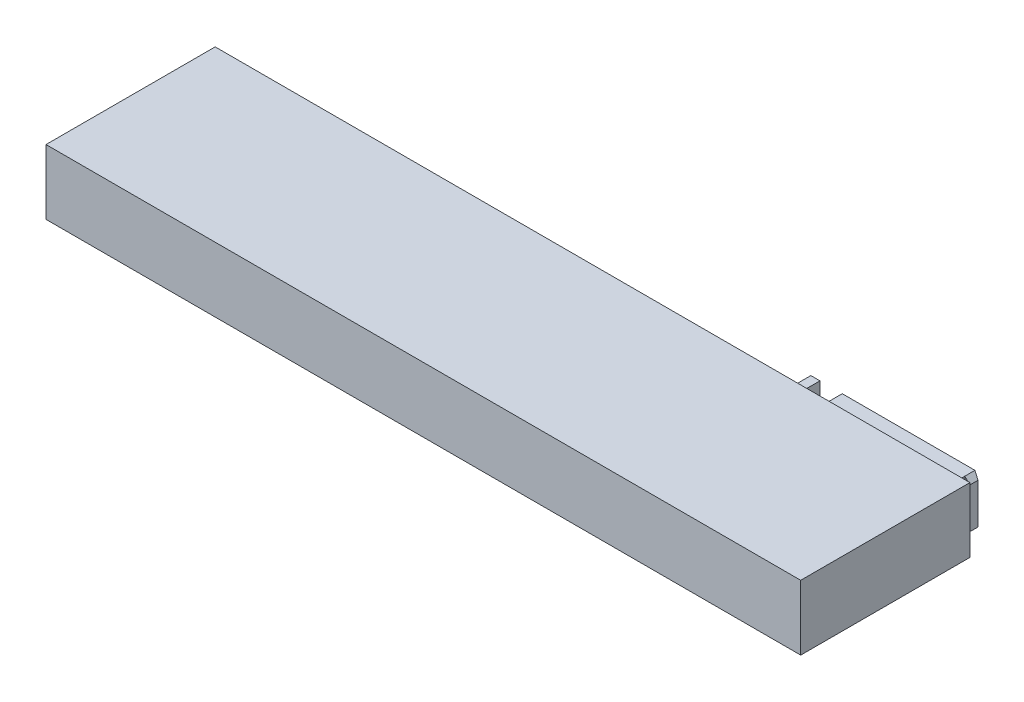
ISO-10303-21;
HEADER;
FILE_DESCRIPTION(('STEP AP214'),'2;1');
FILE_NAME('part.step','',(''),(''),'','','');
FILE_SCHEMA(('AUTOMOTIVE_DESIGN { 1 0 10303 214 1 1 1 1 }'));
ENDSEC;
DATA;
#1=APPLICATION_CONTEXT('core data for automotive mechanical design processes');
#2=APPLICATION_PROTOCOL_DEFINITION('international standard','automotive_design',2000,#1);
#3=PRODUCT_CONTEXT('',#1,'mechanical');
#4=PRODUCT('Part','Part','',(#3));
#5=PRODUCT_RELATED_PRODUCT_CATEGORY('part','',(#4));
#6=PRODUCT_DEFINITION_FORMATION('','',#4);
#7=PRODUCT_DEFINITION_CONTEXT('part definition',#1,'design');
#8=PRODUCT_DEFINITION('design','',#6,#7);
#9=PRODUCT_DEFINITION_SHAPE('','',#8);
#10=(LENGTH_UNIT() NAMED_UNIT(*) SI_UNIT(.MILLI.,.METRE.));
#11=(NAMED_UNIT(*) PLANE_ANGLE_UNIT() SI_UNIT($,.RADIAN.));
#12=(NAMED_UNIT(*) SI_UNIT($,.STERADIAN.) SOLID_ANGLE_UNIT());
#13=UNCERTAINTY_MEASURE_WITH_UNIT(LENGTH_MEASURE(1.E-05),#10,'distance_accuracy_value','');
#14=(GEOMETRIC_REPRESENTATION_CONTEXT(3) GLOBAL_UNCERTAINTY_ASSIGNED_CONTEXT((#13)) GLOBAL_UNIT_ASSIGNED_CONTEXT((#10,
#11,#12)) REPRESENTATION_CONTEXT('',''));
#15=CARTESIAN_POINT('',(0.,0.,0.));
#16=DIRECTION('',(0.,0.,1.));
#17=DIRECTION('',(1.,0.,0.));
#18=AXIS2_PLACEMENT_3D('',#15,#16,#17);
#19=CARTESIAN_POINT('',(0.,6.4,-16.7));
#20=DIRECTION('',(0.,0.,1.));
#21=DIRECTION('',(1.,0.,0.));
#22=AXIS2_PLACEMENT_3D('',#19,#20,#21);
#23=PLANE('',#22);
#24=DIRECTION('',(0.,1.,0.));
#25=VECTOR('',#24,1.);
#26=CARTESIAN_POINT('',(-17.7,5.7,-16.7));
#27=LINE('',#26,#25);
#28=CARTESIAN_POINT('',(-17.7,0.7,-16.7));
#29=VERTEX_POINT('',#28);
#30=CARTESIAN_POINT('',(-17.7,5.7,-16.7));
#31=VERTEX_POINT('',#30);
#32=EDGE_CURVE('E272',#29,#31,#27,.T.);
#33=ORIENTED_EDGE('',*,*,#32,.F.);
#34=DIRECTION('',(-1.,0.,0.));
#35=VECTOR('',#34,1.);
#36=CARTESIAN_POINT('',(-16.8,0.7,-16.7));
#37=LINE('',#36,#35);
#38=CARTESIAN_POINT('',(-16.8,0.7,-16.7));
#39=VERTEX_POINT('',#38);
#40=EDGE_CURVE('E278',#39,#29,#37,.T.);
#41=ORIENTED_EDGE('',*,*,#40,.F.);
#42=DIRECTION('',(0.,-1.,0.));
#43=VECTOR('',#42,1.);
#44=CARTESIAN_POINT('',(-16.8,5.7,-16.7));
#45=LINE('',#44,#43);
#46=CARTESIAN_POINT('',(-16.8,5.7,-16.7));
#47=VERTEX_POINT('',#46);
#48=EDGE_CURVE('E289',#47,#39,#45,.T.);
#49=ORIENTED_EDGE('',*,*,#48,.F.);
#50=DIRECTION('',(1.,0.,0.));
#51=VECTOR('',#50,1.);
#52=CARTESIAN_POINT('',(-16.8,5.7,-16.7));
#53=LINE('',#52,#51);
#54=EDGE_CURVE('E286',#31,#47,#53,.T.);
#55=ORIENTED_EDGE('',*,*,#54,.F.);
#56=EDGE_LOOP('',(#33,#41,#49,#55));
#57=FACE_BOUND('',#56,.T.);
#58=DIRECTION('',(-1.,0.,0.));
#59=VECTOR('',#58,1.);
#60=CARTESIAN_POINT('',(0.,0.,-16.7));
#61=LINE('',#60,#59);
#62=CARTESIAN_POINT('',(0.,0.,-16.7));
#63=VERTEX_POINT('',#62);
#64=CARTESIAN_POINT('',(-74.5,0.,-16.7));
#65=VERTEX_POINT('',#64);
#66=EDGE_CURVE('E347',#63,#65,#61,.T.);
#67=ORIENTED_EDGE('',*,*,#66,.T.);
#68=DIRECTION('',(0.,-1.,0.));
#69=VECTOR('',#68,1.);
#70=CARTESIAN_POINT('',(-74.5,6.4,-16.7));
#71=LINE('',#70,#69);
#72=CARTESIAN_POINT('',(-74.5,6.4,-16.7));
#73=VERTEX_POINT('',#72);
#74=EDGE_CURVE('E357',#73,#65,#71,.T.);
#75=ORIENTED_EDGE('',*,*,#74,.F.);
#76=DIRECTION('',(-1.,0.,0.));
#77=VECTOR('',#76,1.);
#78=CARTESIAN_POINT('',(0.,6.4,-16.7));
#79=LINE('',#78,#77);
#80=CARTESIAN_POINT('',(0.,6.4,-16.7));
#81=VERTEX_POINT('',#80);
#82=EDGE_CURVE('E337',#81,#73,#79,.T.);
#83=ORIENTED_EDGE('',*,*,#82,.F.);
#84=DIRECTION('',(0.,-1.,0.));
#85=VECTOR('',#84,1.);
#86=CARTESIAN_POINT('',(0.,6.4,-16.7));
#87=LINE('',#86,#85);
#88=EDGE_CURVE('E360',#81,#63,#87,.T.);
#89=ORIENTED_EDGE('',*,*,#88,.T.);
#90=EDGE_LOOP('',(#67,#75,#83,#89));
#91=FACE_BOUND('',#90,.T.);
#92=DIRECTION('',(0.,1.,0.));
#93=VECTOR('',#92,1.);
#94=CARTESIAN_POINT('',(-14.6,5.7,-16.7));
#95=LINE('',#94,#93);
#96=CARTESIAN_POINT('',(-14.6,0.7,-16.7));
#97=VERTEX_POINT('',#96);
#98=CARTESIAN_POINT('',(-14.6,5.7,-16.7));
#99=VERTEX_POINT('',#98);
#100=EDGE_CURVE('E303',#97,#99,#95,.T.);
#101=ORIENTED_EDGE('',*,*,#100,.F.);
#102=DIRECTION('',(-1.,0.,0.));
#103=VECTOR('',#102,1.);
#104=CARTESIAN_POINT('',(-1.5,0.7,-16.7));
#105=LINE('',#104,#103);
#106=CARTESIAN_POINT('',(-1.5,0.7,-16.7));
#107=VERTEX_POINT('',#106);
#108=EDGE_CURVE('E308',#107,#97,#105,.T.);
#109=ORIENTED_EDGE('',*,*,#108,.F.);
#110=DIRECTION('',(0.,-1.,0.));
#111=VECTOR('',#110,1.);
#112=CARTESIAN_POINT('',(-1.5,5.7,-16.7));
#113=LINE('',#112,#111);
#114=CARTESIAN_POINT('',(-1.5,5.7,-16.7));
#115=VERTEX_POINT('',#114);
#116=EDGE_CURVE('E319',#115,#107,#113,.T.);
#117=ORIENTED_EDGE('',*,*,#116,.F.);
#118=DIRECTION('',(1.,0.,0.));
#119=VECTOR('',#118,1.);
#120=CARTESIAN_POINT('',(-1.5,5.7,-16.7));
#121=LINE('',#120,#119);
#122=EDGE_CURVE('E316',#99,#115,#121,.T.);
#123=ORIENTED_EDGE('',*,*,#122,.F.);
#124=EDGE_LOOP('',(#101,#109,#117,#123));
#125=FACE_BOUND('',#124,.T.);
#126=DIRECTION('',(0.,1.,0.));
#127=VECTOR('',#126,1.);
#128=CARTESIAN_POINT('',(-26.5,5.2,-16.7));
#129=LINE('',#128,#127);
#130=CARTESIAN_POINT('',(-26.5,1.2,-16.7));
#131=VERTEX_POINT('',#130);
#132=CARTESIAN_POINT('',(-26.5,5.2,-16.7));
#133=VERTEX_POINT('',#132);
#134=EDGE_CURVE('E208',#131,#133,#129,.T.);
#135=ORIENTED_EDGE('',*,*,#134,.F.);
#136=DIRECTION('',(-1.,0.,0.));
#137=VECTOR('',#136,1.);
#138=CARTESIAN_POINT('',(-21.5,1.2,-16.7));
#139=LINE('',#138,#137);
#140=CARTESIAN_POINT('',(-21.5,1.2,-16.7));
#141=VERTEX_POINT('',#140);
#142=EDGE_CURVE('E205',#141,#131,#139,.T.);
#143=ORIENTED_EDGE('',*,*,#142,.F.);
#144=DIRECTION('',(0.,-1.,0.));
#145=VECTOR('',#144,1.);
#146=CARTESIAN_POINT('',(-21.5,5.2,-16.7));
#147=LINE('',#146,#145);
#148=CARTESIAN_POINT('',(-21.5,5.2,-16.7));
#149=VERTEX_POINT('',#148);
#150=EDGE_CURVE('E59',#149,#141,#147,.T.);
#151=ORIENTED_EDGE('',*,*,#150,.F.);
#152=DIRECTION('',(1.,0.,0.));
#153=VECTOR('',#152,1.);
#154=CARTESIAN_POINT('',(-21.5,5.2,-16.7));
#155=LINE('',#154,#153);
#156=EDGE_CURVE('E54',#133,#149,#155,.T.);
#157=ORIENTED_EDGE('',*,*,#156,.F.);
#158=EDGE_LOOP('',(#135,#143,#151,#157));
#159=FACE_BOUND('',#158,.T.);
#160=ADVANCED_FACE('F38',(#57,#91,#125,#159),#23,.F.);
#161=CARTESIAN_POINT('',(-17.7,5.7,-18.7));
#162=DIRECTION('',(1.,0.,0.));
#163=DIRECTION('',(0.,0.,-1.));
#164=AXIS2_PLACEMENT_3D('',#161,#162,#163);
#165=PLANE('',#164);
#166=DIRECTION('',(0.,1.,0.));
#167=VECTOR('',#166,1.);
#168=CARTESIAN_POINT('',(-17.7,0.7,-17.7));
#169=LINE('',#168,#167);
#170=CARTESIAN_POINT('',(-17.7,0.7,-17.7));
#171=VERTEX_POINT('',#170);
#172=CARTESIAN_POINT('',(-17.7,5.7,-17.7));
#173=VERTEX_POINT('',#172);
#174=EDGE_CURVE('E209',#171,#173,#169,.T.);
#175=ORIENTED_EDGE('',*,*,#174,.F.);
#176=DIRECTION('',(0.,0.,1.));
#177=VECTOR('',#176,1.);
#178=CARTESIAN_POINT('',(-17.7,0.7,-18.7));
#179=LINE('',#178,#177);
#180=EDGE_CURVE('E283',#171,#29,#179,.T.);
#181=ORIENTED_EDGE('',*,*,#180,.T.);
#182=ORIENTED_EDGE('',*,*,#32,.T.);
#183=DIRECTION('',(0.,0.,1.));
#184=VECTOR('',#183,1.);
#185=CARTESIAN_POINT('',(-17.7,5.7,-18.7));
#186=LINE('',#185,#184);
#187=EDGE_CURVE('E301',#173,#31,#186,.T.);
#188=ORIENTED_EDGE('',*,*,#187,.F.);
#189=EDGE_LOOP('',(#175,#181,#182,#188));
#190=FACE_BOUND('',#189,.T.);
#191=ADVANCED_FACE('F452',(#190),#165,.F.);
#192=CARTESIAN_POINT('',(-1.5,5.7,-18.7));
#193=DIRECTION('',(-1.,0.,0.));
#194=DIRECTION('',(0.,0.,1.));
#195=AXIS2_PLACEMENT_3D('',#192,#193,#194);
#196=PLANE('',#195);
#197=DIRECTION('',(0.,-1.,0.));
#198=VECTOR('',#197,1.);
#199=CARTESIAN_POINT('',(-1.5,5.7,-17.7));
#200=LINE('',#199,#198);
#201=CARTESIAN_POINT('',(-1.5,5.7,-17.7));
#202=VERTEX_POINT('',#201);
#203=CARTESIAN_POINT('',(-1.5,0.7,-17.7));
#204=VERTEX_POINT('',#203);
#205=EDGE_CURVE('E219',#202,#204,#200,.T.);
#206=ORIENTED_EDGE('',*,*,#205,.F.);
#207=DIRECTION('',(0.,0.,1.));
#208=VECTOR('',#207,1.);
#209=CARTESIAN_POINT('',(-1.5,5.7,-18.7));
#210=LINE('',#209,#208);
#211=EDGE_CURVE('E328',#202,#115,#210,.T.);
#212=ORIENTED_EDGE('',*,*,#211,.T.);
#213=ORIENTED_EDGE('',*,*,#116,.T.);
#214=DIRECTION('',(0.,0.,1.));
#215=VECTOR('',#214,1.);
#216=CARTESIAN_POINT('',(-1.5,0.7,-18.7));
#217=LINE('',#216,#215);
#218=EDGE_CURVE('E326',#204,#107,#217,.T.);
#219=ORIENTED_EDGE('',*,*,#218,.F.);
#220=EDGE_LOOP('',(#206,#212,#213,#219));
#221=FACE_BOUND('',#220,.T.);
#222=ADVANCED_FACE('F426',(#221),#196,.F.);
#223=CARTESIAN_POINT('',(0.,6.4,0.));
#224=DIRECTION('',(-1.,0.,0.));
#225=DIRECTION('',(0.,0.,1.));
#226=AXIS2_PLACEMENT_3D('',#223,#224,#225);
#227=PLANE('',#226);
#228=DIRECTION('',(0.,0.,-1.));
#229=VECTOR('',#228,1.);
#230=CARTESIAN_POINT('',(0.,0.,0.));
#231=LINE('',#230,#229);
#232=CARTESIAN_POINT('',(0.,0.,0.));
#233=VERTEX_POINT('',#232);
#234=EDGE_CURVE('E333',#233,#63,#231,.T.);
#235=ORIENTED_EDGE('',*,*,#234,.T.);
#236=ORIENTED_EDGE('',*,*,#88,.F.);
#237=DIRECTION('',(0.,0.,-1.));
#238=VECTOR('',#237,1.);
#239=CARTESIAN_POINT('',(0.,6.4,0.));
#240=LINE('',#239,#238);
#241=CARTESIAN_POINT('',(0.,6.4,0.));
#242=VERTEX_POINT('',#241);
#243=EDGE_CURVE('E334',#242,#81,#240,.T.);
#244=ORIENTED_EDGE('',*,*,#243,.F.);
#245=DIRECTION('',(0.,-1.,0.));
#246=VECTOR('',#245,1.);
#247=CARTESIAN_POINT('',(0.,6.4,0.));
#248=LINE('',#247,#246);
#249=EDGE_CURVE('E344',#242,#233,#248,.T.);
#250=ORIENTED_EDGE('',*,*,#249,.T.);
#251=EDGE_LOOP('',(#235,#236,#244,#250));
#252=FACE_BOUND('',#251,.T.);
#253=ADVANCED_FACE('F466',(#252),#227,.F.);
#254=CARTESIAN_POINT('',(-74.5,6.4,0.));
#255=DIRECTION('',(1.,0.,0.));
#256=DIRECTION('',(0.,0.,-1.));
#257=AXIS2_PLACEMENT_3D('',#254,#255,#256);
#258=PLANE('',#257);
#259=DIRECTION('',(0.,0.,1.));
#260=VECTOR('',#259,1.);
#261=CARTESIAN_POINT('',(-74.5,0.,0.));
#262=LINE('',#261,#260);
#263=CARTESIAN_POINT('',(-74.5,0.,0.));
#264=VERTEX_POINT('',#263);
#265=EDGE_CURVE('E349',#65,#264,#262,.T.);
#266=ORIENTED_EDGE('',*,*,#265,.T.);
#267=DIRECTION('',(0.,-1.,0.));
#268=VECTOR('',#267,1.);
#269=CARTESIAN_POINT('',(-74.5,6.4,0.));
#270=LINE('',#269,#268);
#271=CARTESIAN_POINT('',(-74.5,6.4,0.));
#272=VERTEX_POINT('',#271);
#273=EDGE_CURVE('E354',#272,#264,#270,.T.);
#274=ORIENTED_EDGE('',*,*,#273,.F.);
#275=DIRECTION('',(0.,0.,1.));
#276=VECTOR('',#275,1.);
#277=CARTESIAN_POINT('',(-74.5,6.4,0.));
#278=LINE('',#277,#276);
#279=EDGE_CURVE('E340',#73,#272,#278,.T.);
#280=ORIENTED_EDGE('',*,*,#279,.F.);
#281=ORIENTED_EDGE('',*,*,#74,.T.);
#282=EDGE_LOOP('',(#266,#274,#280,#281));
#283=FACE_BOUND('',#282,.T.);
#284=ADVANCED_FACE('F464',(#283),#258,.F.);
#285=CARTESIAN_POINT('',(0.,6.4,0.));
#286=DIRECTION('',(0.,0.,-1.));
#287=DIRECTION('',(-1.,0.,0.));
#288=AXIS2_PLACEMENT_3D('',#285,#286,#287);
#289=PLANE('',#288);
#290=DIRECTION('',(1.,0.,0.));
#291=VECTOR('',#290,1.);
#292=CARTESIAN_POINT('',(0.,0.,0.));
#293=LINE('',#292,#291);
#294=EDGE_CURVE('E338',#264,#233,#293,.T.);
#295=ORIENTED_EDGE('',*,*,#294,.T.);
#296=ORIENTED_EDGE('',*,*,#249,.F.);
#297=DIRECTION('',(1.,0.,0.));
#298=VECTOR('',#297,1.);
#299=CARTESIAN_POINT('',(0.,6.4,0.));
#300=LINE('',#299,#298);
#301=EDGE_CURVE('E342',#272,#242,#300,.T.);
#302=ORIENTED_EDGE('',*,*,#301,.F.);
#303=ORIENTED_EDGE('',*,*,#273,.T.);
#304=EDGE_LOOP('',(#295,#296,#302,#303));
#305=FACE_BOUND('',#304,.T.);
#306=ADVANCED_FACE('F611',(#305),#289,.F.);
#307=CARTESIAN_POINT('',(0.,6.4,0.));
#308=DIRECTION('',(0.,1.,0.));
#309=DIRECTION('',(0.,0.,1.));
#310=AXIS2_PLACEMENT_3D('',#307,#308,#309);
#311=PLANE('',#310);
#312=ORIENTED_EDGE('',*,*,#243,.T.);
#313=ORIENTED_EDGE('',*,*,#82,.T.);
#314=ORIENTED_EDGE('',*,*,#279,.T.);
#315=ORIENTED_EDGE('',*,*,#301,.T.);
#316=EDGE_LOOP('',(#312,#313,#314,#315));
#317=FACE_BOUND('',#316,.T.);
#318=ADVANCED_FACE('F608',(#317),#311,.T.);
#319=CARTESIAN_POINT('',(0.,0.,0.));
#320=DIRECTION('',(0.,1.,0.));
#321=DIRECTION('',(0.,0.,1.));
#322=AXIS2_PLACEMENT_3D('',#319,#320,#321);
#323=PLANE('',#322);
#324=ORIENTED_EDGE('',*,*,#234,.F.);
#325=ORIENTED_EDGE('',*,*,#294,.F.);
#326=ORIENTED_EDGE('',*,*,#265,.F.);
#327=ORIENTED_EDGE('',*,*,#66,.F.);
#328=EDGE_LOOP('',(#324,#325,#326,#327));
#329=FACE_BOUND('',#328,.T.);
#330=ADVANCED_FACE('F606',(#329),#323,.F.);
#331=CARTESIAN_POINT('',(-14.6,5.7,-18.7));
#332=DIRECTION('',(1.,0.,0.));
#333=DIRECTION('',(0.,0.,-1.));
#334=AXIS2_PLACEMENT_3D('',#331,#332,#333);
#335=PLANE('',#334);
#336=ORIENTED_EDGE('',*,*,#100,.T.);
#337=DIRECTION('',(0.,0.,1.));
#338=VECTOR('',#337,1.);
#339=CARTESIAN_POINT('',(-14.6,5.7,-18.7));
#340=LINE('',#339,#338);
#341=CARTESIAN_POINT('',(-14.6,5.7,-18.7));
#342=VERTEX_POINT('',#341);
#343=EDGE_CURVE('E330',#342,#99,#340,.T.);
#344=ORIENTED_EDGE('',*,*,#343,.F.);
#345=DIRECTION('',(0.,1.,0.));
#346=VECTOR('',#345,1.);
#347=CARTESIAN_POINT('',(-14.6,5.7,-18.7));
#348=LINE('',#347,#346);
#349=CARTESIAN_POINT('',(-14.6,0.7,-18.7));
#350=VERTEX_POINT('',#349);
#351=EDGE_CURVE('E304',#350,#342,#348,.T.);
#352=ORIENTED_EDGE('',*,*,#351,.F.);
#353=DIRECTION('',(0.,0.,1.));
#354=VECTOR('',#353,1.);
#355=CARTESIAN_POINT('',(-14.6,0.7,-18.7));
#356=LINE('',#355,#354);
#357=EDGE_CURVE('E313',#350,#97,#356,.T.);
#358=ORIENTED_EDGE('',*,*,#357,.T.);
#359=EDGE_LOOP('',(#336,#344,#352,#358));
#360=FACE_BOUND('',#359,.T.);
#361=ADVANCED_FACE('F603',(#360),#335,.F.);
#362=CARTESIAN_POINT('',(-1.5,5.7,-18.7));
#363=DIRECTION('',(0.,-1.,0.));
#364=DIRECTION('',(0.,0.,-1.));
#365=AXIS2_PLACEMENT_3D('',#362,#363,#364);
#366=PLANE('',#365);
#367=ORIENTED_EDGE('',*,*,#211,.F.);
#368=DIRECTION('',(0.,0.,-1.));
#369=VECTOR('',#368,1.);
#370=CARTESIAN_POINT('',(-1.5,5.7,-18.7));
#371=LINE('',#370,#369);
#372=CARTESIAN_POINT('',(-1.49999999999999,5.7,-18.7));
#373=VERTEX_POINT('',#372);
#374=EDGE_CURVE('E403',#202,#373,#371,.T.);
#375=ORIENTED_EDGE('',*,*,#374,.T.);
#376=DIRECTION('',(1.,0.,0.));
#377=VECTOR('',#376,1.);
#378=CARTESIAN_POINT('',(-1.5,5.7,-18.7));
#379=LINE('',#378,#377);
#380=EDGE_CURVE('E307',#342,#373,#379,.T.);
#381=ORIENTED_EDGE('',*,*,#380,.F.);
#382=ORIENTED_EDGE('',*,*,#343,.T.);
#383=ORIENTED_EDGE('',*,*,#122,.T.);
#384=EDGE_LOOP('',(#367,#375,#381,#382,#383));
#385=FACE_BOUND('',#384,.T.);
#386=ADVANCED_FACE('F438',(#385),#366,.F.);
#387=CARTESIAN_POINT('',(-1.5,0.7,-18.7));
#388=DIRECTION('',(0.,1.,0.));
#389=DIRECTION('',(0.,0.,1.));
#390=AXIS2_PLACEMENT_3D('',#387,#388,#389);
#391=PLANE('',#390);
#392=DIRECTION('',(-1.,0.,0.));
#393=VECTOR('',#392,1.);
#394=CARTESIAN_POINT('',(-1.5,0.7,-18.7));
#395=LINE('',#394,#393);
#396=CARTESIAN_POINT('',(-1.49999999999999,0.7,-18.7));
#397=VERTEX_POINT('',#396);
#398=EDGE_CURVE('E311',#397,#350,#395,.T.);
#399=ORIENTED_EDGE('',*,*,#398,.F.);
#400=DIRECTION('',(0.,0.,1.));
#401=VECTOR('',#400,1.);
#402=CARTESIAN_POINT('',(-1.5,0.7,-18.7));
#403=LINE('',#402,#401);
#404=EDGE_CURVE('E42',#397,#204,#403,.T.);
#405=ORIENTED_EDGE('',*,*,#404,.T.);
#406=ORIENTED_EDGE('',*,*,#218,.T.);
#407=ORIENTED_EDGE('',*,*,#108,.T.);
#408=ORIENTED_EDGE('',*,*,#357,.F.);
#409=EDGE_LOOP('',(#399,#405,#406,#407,#408));
#410=FACE_BOUND('',#409,.T.);
#411=ADVANCED_FACE('F414',(#410),#391,.F.);
#412=CARTESIAN_POINT('',(0.,0.,-18.7));
#413=DIRECTION('',(0.,0.,-1.));
#414=DIRECTION('',(-1.,0.,0.));
#415=AXIS2_PLACEMENT_3D('',#412,#413,#414);
#416=PLANE('',#415);
#417=CARTESIAN_POINT('',(-7.6,4.45,-18.7));
#418=DIRECTION('',(0.,0.,-1.));
#419=DIRECTION('',(-1.,0.,0.));
#420=AXIS2_PLACEMENT_3D('',#417,#418,#419);
#421=CIRCLE('',#420,1.05);
#422=CARTESIAN_POINT('',(-8.65,4.45,-18.7));
#423=VERTEX_POINT('',#422);
#424=EDGE_CURVE('E249',#423,#423,#421,.T.);
#425=ORIENTED_EDGE('',*,*,#424,.F.);
#426=EDGE_LOOP('',(#425));
#427=FACE_BOUND('',#426,.T.);
#428=CARTESIAN_POINT('',(-10.1,4.45,-18.7));
#429=DIRECTION('',(0.,0.,-1.));
#430=DIRECTION('',(-1.,0.,0.));
#431=AXIS2_PLACEMENT_3D('',#428,#429,#430);
#432=CIRCLE('',#431,1.05);
#433=CARTESIAN_POINT('',(-11.15,4.45,-18.7));
#434=VERTEX_POINT('',#433);
#435=EDGE_CURVE('E255',#434,#434,#432,.T.);
#436=ORIENTED_EDGE('',*,*,#435,.F.);
#437=EDGE_LOOP('',(#436));
#438=FACE_BOUND('',#437,.T.);
#439=CARTESIAN_POINT('',(-12.6,4.45,-18.7));
#440=DIRECTION('',(0.,0.,-1.));
#441=DIRECTION('',(-1.,0.,0.));
#442=AXIS2_PLACEMENT_3D('',#439,#440,#441);
#443=CIRCLE('',#442,1.05);
#444=CARTESIAN_POINT('',(-13.65,4.45,-18.7));
#445=VERTEX_POINT('',#444);
#446=EDGE_CURVE('E261',#445,#445,#443,.T.);
#447=ORIENTED_EDGE('',*,*,#446,.F.);
#448=EDGE_LOOP('',(#447));
#449=FACE_BOUND('',#448,.T.);
#450=CARTESIAN_POINT('',(-12.6,1.95,-18.7));
#451=DIRECTION('',(0.,0.,-1.));
#452=DIRECTION('',(-1.,0.,0.));
#453=AXIS2_PLACEMENT_3D('',#450,#451,#452);
#454=CIRCLE('',#453,1.05);
#455=CARTESIAN_POINT('',(-13.65,1.95,-18.7));
#456=VERTEX_POINT('',#455);
#457=EDGE_CURVE('E230',#456,#456,#454,.T.);
#458=ORIENTED_EDGE('',*,*,#457,.F.);
#459=EDGE_LOOP('',(#458));
#460=FACE_BOUND('',#459,.T.);
#461=CARTESIAN_POINT('',(-10.1,1.95,-18.7));
#462=DIRECTION('',(0.,0.,-1.));
#463=DIRECTION('',(-1.,0.,0.));
#464=AXIS2_PLACEMENT_3D('',#461,#462,#463);
#465=CIRCLE('',#464,1.05);
#466=CARTESIAN_POINT('',(-11.15,1.95,-18.7));
#467=VERTEX_POINT('',#466);
#468=EDGE_CURVE('E231',#467,#467,#465,.T.);
#469=ORIENTED_EDGE('',*,*,#468,.F.);
#470=EDGE_LOOP('',(#469));
#471=FACE_BOUND('',#470,.T.);
#472=CARTESIAN_POINT('',(-7.6,1.95,-18.7));
#473=DIRECTION('',(0.,0.,-1.));
#474=DIRECTION('',(-1.,0.,0.));
#475=AXIS2_PLACEMENT_3D('',#472,#473,#474);
#476=CIRCLE('',#475,1.05);
#477=CARTESIAN_POINT('',(-8.65,1.95,-18.7));
#478=VERTEX_POINT('',#477);
#479=EDGE_CURVE('E237',#478,#478,#476,.T.);
#480=ORIENTED_EDGE('',*,*,#479,.F.);
#481=EDGE_LOOP('',(#480));
#482=FACE_BOUND('',#481,.T.);
#483=CARTESIAN_POINT('',(-5.1,1.95,-18.7));
#484=DIRECTION('',(0.,0.,-1.));
#485=DIRECTION('',(-1.,0.,0.));
#486=AXIS2_PLACEMENT_3D('',#483,#484,#485);
#487=CIRCLE('',#486,1.05);
#488=CARTESIAN_POINT('',(-6.15,1.95,-18.7));
#489=VERTEX_POINT('',#488);
#490=EDGE_CURVE('E224',#489,#489,#487,.T.);
#491=ORIENTED_EDGE('',*,*,#490,.F.);
#492=EDGE_LOOP('',(#491));
#493=FACE_BOUND('',#492,.T.);
#494=CARTESIAN_POINT('',(-5.1,4.45,-18.7));
#495=DIRECTION('',(0.,0.,-1.));
#496=DIRECTION('',(-1.,0.,0.));
#497=AXIS2_PLACEMENT_3D('',#494,#495,#496);
#498=CIRCLE('',#497,1.05);
#499=CARTESIAN_POINT('',(-6.15,4.45,-18.7));
#500=VERTEX_POINT('',#499);
#501=EDGE_CURVE('E248',#500,#500,#498,.T.);
#502=ORIENTED_EDGE('',*,*,#501,.F.);
#503=EDGE_LOOP('',(#502));
#504=FACE_BOUND('',#503,.T.);
#505=ORIENTED_EDGE('',*,*,#380,.T.);
#506=DIRECTION('',(0.,-1.,0.));
#507=VECTOR('',#506,1.);
#508=CARTESIAN_POINT('',(-1.49999999999999,0.7,-18.7));
#509=LINE('',#508,#507);
#510=EDGE_CURVE('E372',#373,#397,#509,.T.);
#511=ORIENTED_EDGE('',*,*,#510,.T.);
#512=ORIENTED_EDGE('',*,*,#398,.T.);
#513=ORIENTED_EDGE('',*,*,#351,.T.);
#514=EDGE_LOOP('',(#505,#511,#512,#513));
#515=FACE_BOUND('',#514,.T.);
#516=ADVANCED_FACE('F434',(#427,#438,#449,#460,#471,#482,#493,#504,#515),#416,.T.);
#517=CARTESIAN_POINT('',(-16.8,5.7,-18.7));
#518=DIRECTION('',(0.,-1.,0.));
#519=DIRECTION('',(0.,0.,-1.));
#520=AXIS2_PLACEMENT_3D('',#517,#518,#519);
#521=PLANE('',#520);
#522=DIRECTION('',(1.,0.,0.));
#523=VECTOR('',#522,1.);
#524=CARTESIAN_POINT('',(-16.8,5.7,-18.7));
#525=LINE('',#524,#523);
#526=CARTESIAN_POINT('',(-17.7,5.7,-18.7));
#527=VERTEX_POINT('',#526);
#528=CARTESIAN_POINT('',(-16.8,5.7,-18.7));
#529=VERTEX_POINT('',#528);
#530=EDGE_CURVE('E275',#527,#529,#525,.T.);
#531=ORIENTED_EDGE('',*,*,#530,.F.);
#532=DIRECTION('',(0.,0.,1.));
#533=VECTOR('',#532,1.);
#534=CARTESIAN_POINT('',(-17.7,5.7,-18.7));
#535=LINE('',#534,#533);
#536=EDGE_CURVE('E391',#527,#173,#535,.T.);
#537=ORIENTED_EDGE('',*,*,#536,.T.);
#538=ORIENTED_EDGE('',*,*,#187,.T.);
#539=ORIENTED_EDGE('',*,*,#54,.T.);
#540=DIRECTION('',(0.,0.,1.));
#541=VECTOR('',#540,1.);
#542=CARTESIAN_POINT('',(-16.8,5.7,-18.7));
#543=LINE('',#542,#541);
#544=EDGE_CURVE('E298',#529,#47,#543,.T.);
#545=ORIENTED_EDGE('',*,*,#544,.F.);
#546=EDGE_LOOP('',(#531,#537,#538,#539,#545));
#547=FACE_BOUND('',#546,.T.);
#548=ADVANCED_FACE('F497',(#547),#521,.F.);
#549=CARTESIAN_POINT('',(-16.8,5.7,-18.7));
#550=DIRECTION('',(-1.,0.,0.));
#551=DIRECTION('',(0.,0.,1.));
#552=AXIS2_PLACEMENT_3D('',#549,#550,#551);
#553=PLANE('',#552);
#554=ORIENTED_EDGE('',*,*,#48,.T.);
#555=DIRECTION('',(0.,0.,1.));
#556=VECTOR('',#555,1.);
#557=CARTESIAN_POINT('',(-16.8,0.7,-18.7));
#558=LINE('',#557,#556);
#559=CARTESIAN_POINT('',(-16.8,0.7,-18.7));
#560=VERTEX_POINT('',#559);
#561=EDGE_CURVE('E295',#560,#39,#558,.T.);
#562=ORIENTED_EDGE('',*,*,#561,.F.);
#563=DIRECTION('',(0.,-1.,0.));
#564=VECTOR('',#563,1.);
#565=CARTESIAN_POINT('',(-16.8,5.7,-18.7));
#566=LINE('',#565,#564);
#567=EDGE_CURVE('E277',#529,#560,#566,.T.);
#568=ORIENTED_EDGE('',*,*,#567,.F.);
#569=ORIENTED_EDGE('',*,*,#544,.T.);
#570=EDGE_LOOP('',(#554,#562,#568,#569));
#571=FACE_BOUND('',#570,.T.);
#572=ADVANCED_FACE('F502',(#571),#553,.F.);
#573=CARTESIAN_POINT('',(-16.8,0.7,-18.7));
#574=DIRECTION('',(0.,1.,0.));
#575=DIRECTION('',(0.,0.,1.));
#576=AXIS2_PLACEMENT_3D('',#573,#574,#575);
#577=PLANE('',#576);
#578=ORIENTED_EDGE('',*,*,#180,.F.);
#579=DIRECTION('',(0.,0.,-1.));
#580=VECTOR('',#579,1.);
#581=CARTESIAN_POINT('',(-17.7,0.7,-18.7));
#582=LINE('',#581,#580);
#583=CARTESIAN_POINT('',(-17.7,0.7,-18.7));
#584=VERTEX_POINT('',#583);
#585=EDGE_CURVE('E385',#171,#584,#582,.T.);
#586=ORIENTED_EDGE('',*,*,#585,.T.);
#587=DIRECTION('',(-1.,0.,0.));
#588=VECTOR('',#587,1.);
#589=CARTESIAN_POINT('',(-16.8,0.7,-18.7));
#590=LINE('',#589,#588);
#591=EDGE_CURVE('E280',#560,#584,#590,.T.);
#592=ORIENTED_EDGE('',*,*,#591,.F.);
#593=ORIENTED_EDGE('',*,*,#561,.T.);
#594=ORIENTED_EDGE('',*,*,#40,.T.);
#595=EDGE_LOOP('',(#578,#586,#592,#593,#594));
#596=FACE_BOUND('',#595,.T.);
#597=ADVANCED_FACE('F505',(#596),#577,.F.);
#598=CARTESIAN_POINT('',(0.,0.,-18.7));
#599=DIRECTION('',(0.,0.,-1.));
#600=DIRECTION('',(-1.,0.,0.));
#601=AXIS2_PLACEMENT_3D('',#598,#599,#600);
#602=PLANE('',#601);
#603=ORIENTED_EDGE('',*,*,#591,.T.);
#604=DIRECTION('',(0.,1.,0.));
#605=VECTOR('',#604,1.);
#606=CARTESIAN_POINT('',(-17.7,5.7,-18.7));
#607=LINE('',#606,#605);
#608=EDGE_CURVE('E366',#584,#527,#607,.T.);
#609=ORIENTED_EDGE('',*,*,#608,.T.);
#610=ORIENTED_EDGE('',*,*,#530,.T.);
#611=ORIENTED_EDGE('',*,*,#567,.T.);
#612=EDGE_LOOP('',(#603,#609,#610,#611));
#613=FACE_BOUND('',#612,.T.);
#614=ADVANCED_FACE('F493',(#613),#602,.T.);
#615=CARTESIAN_POINT('',(-5.1,4.45,-3.7));
#616=DIRECTION('',(0.,0.,-1.));
#617=DIRECTION('',(-1.,0.,0.));
#618=AXIS2_PLACEMENT_3D('',#615,#616,#617);
#619=CYLINDRICAL_SURFACE('',#618,1.05);
#620=CARTESIAN_POINT('',(-5.1,4.45,-3.7));
#621=DIRECTION('',(0.,0.,-1.));
#622=DIRECTION('',(-1.,0.,0.));
#623=AXIS2_PLACEMENT_3D('',#620,#621,#622);
#624=CIRCLE('',#623,1.05);
#625=CARTESIAN_POINT('',(-6.15,4.45,-3.7));
#626=VERTEX_POINT('',#625);
#627=EDGE_CURVE('E269',#626,#626,#624,.T.);
#628=ORIENTED_EDGE('',*,*,#627,.F.);
#629=EDGE_LOOP('',(#628));
#630=FACE_BOUND('',#629,.T.);
#631=ORIENTED_EDGE('',*,*,#501,.T.);
#632=EDGE_LOOP('',(#631));
#633=FACE_BOUND('',#632,.T.);
#634=ADVANCED_FACE('F581',(#630,#633),#619,.F.);
#635=CARTESIAN_POINT('',(-5.1,4.45,-3.7));
#636=DIRECTION('',(0.,0.,-1.));
#637=DIRECTION('',(-1.,0.,0.));
#638=AXIS2_PLACEMENT_3D('',#635,#636,#637);
#639=PLANE('',#638);
#640=ORIENTED_EDGE('',*,*,#627,.T.);
#641=EDGE_LOOP('',(#640));
#642=FACE_BOUND('',#641,.T.);
#643=ADVANCED_FACE('F547',(#642),#639,.T.);
#644=CARTESIAN_POINT('',(-5.1,1.95,-3.7));
#645=DIRECTION('',(0.,0.,-1.));
#646=DIRECTION('',(-1.,0.,0.));
#647=AXIS2_PLACEMENT_3D('',#644,#645,#646);
#648=CYLINDRICAL_SURFACE('',#647,1.05);
#649=CARTESIAN_POINT('',(-5.1,1.95,-3.7));
#650=DIRECTION('',(0.,0.,-1.));
#651=DIRECTION('',(-1.,0.,0.));
#652=AXIS2_PLACEMENT_3D('',#649,#650,#651);
#653=CIRCLE('',#652,1.05);
#654=CARTESIAN_POINT('',(-6.15,1.95,-3.7));
#655=VERTEX_POINT('',#654);
#656=EDGE_CURVE('E240',#655,#655,#653,.T.);
#657=ORIENTED_EDGE('',*,*,#656,.F.);
#658=EDGE_LOOP('',(#657));
#659=FACE_BOUND('',#658,.T.);
#660=ORIENTED_EDGE('',*,*,#490,.T.);
#661=EDGE_LOOP('',(#660));
#662=FACE_BOUND('',#661,.T.);
#663=ADVANCED_FACE('F543',(#659,#662),#648,.F.);
#664=CARTESIAN_POINT('',(-5.1,1.95,-3.7));
#665=DIRECTION('',(0.,0.,-1.));
#666=DIRECTION('',(-1.,0.,0.));
#667=AXIS2_PLACEMENT_3D('',#664,#665,#666);
#668=PLANE('',#667);
#669=ORIENTED_EDGE('',*,*,#656,.T.);
#670=EDGE_LOOP('',(#669));
#671=FACE_BOUND('',#670,.T.);
#672=ADVANCED_FACE('F539',(#671),#668,.T.);
#673=CARTESIAN_POINT('',(-7.6,1.95,-3.7));
#674=DIRECTION('',(0.,0.,-1.));
#675=DIRECTION('',(-1.,0.,0.));
#676=AXIS2_PLACEMENT_3D('',#673,#674,#675);
#677=CYLINDRICAL_SURFACE('',#676,1.05);
#678=CARTESIAN_POINT('',(-7.6,1.95,-3.7));
#679=DIRECTION('',(0.,0.,-1.));
#680=DIRECTION('',(-1.,0.,0.));
#681=AXIS2_PLACEMENT_3D('',#678,#679,#680);
#682=CIRCLE('',#681,1.05);
#683=CARTESIAN_POINT('',(-8.65,1.95,-3.7));
#684=VERTEX_POINT('',#683);
#685=EDGE_CURVE('E234',#684,#684,#682,.T.);
#686=ORIENTED_EDGE('',*,*,#685,.F.);
#687=EDGE_LOOP('',(#686));
#688=FACE_BOUND('',#687,.T.);
#689=ORIENTED_EDGE('',*,*,#479,.T.);
#690=EDGE_LOOP('',(#689));
#691=FACE_BOUND('',#690,.T.);
#692=ADVANCED_FACE('F535',(#688,#691),#677,.F.);
#693=CARTESIAN_POINT('',(-7.6,1.95,-3.7));
#694=DIRECTION('',(0.,0.,-1.));
#695=DIRECTION('',(-1.,0.,0.));
#696=AXIS2_PLACEMENT_3D('',#693,#694,#695);
#697=PLANE('',#696);
#698=ORIENTED_EDGE('',*,*,#685,.T.);
#699=EDGE_LOOP('',(#698));
#700=FACE_BOUND('',#699,.T.);
#701=ADVANCED_FACE('F531',(#700),#697,.T.);
#702=CARTESIAN_POINT('',(-10.1,1.95,-3.7));
#703=DIRECTION('',(0.,0.,-1.));
#704=DIRECTION('',(-1.,0.,0.));
#705=AXIS2_PLACEMENT_3D('',#702,#703,#704);
#706=CYLINDRICAL_SURFACE('',#705,1.05);
#707=CARTESIAN_POINT('',(-10.1,1.95,-3.7));
#708=DIRECTION('',(0.,0.,-1.));
#709=DIRECTION('',(-1.,0.,0.));
#710=AXIS2_PLACEMENT_3D('',#707,#708,#709);
#711=CIRCLE('',#710,1.05);
#712=CARTESIAN_POINT('',(-11.15,1.95,-3.7));
#713=VERTEX_POINT('',#712);
#714=EDGE_CURVE('E227',#713,#713,#711,.T.);
#715=ORIENTED_EDGE('',*,*,#714,.F.);
#716=EDGE_LOOP('',(#715));
#717=FACE_BOUND('',#716,.T.);
#718=ORIENTED_EDGE('',*,*,#468,.T.);
#719=EDGE_LOOP('',(#718));
#720=FACE_BOUND('',#719,.T.);
#721=ADVANCED_FACE('F527',(#717,#720),#706,.F.);
#722=CARTESIAN_POINT('',(-10.1,1.95,-3.7));
#723=DIRECTION('',(0.,0.,-1.));
#724=DIRECTION('',(-1.,0.,0.));
#725=AXIS2_PLACEMENT_3D('',#722,#723,#724);
#726=PLANE('',#725);
#727=ORIENTED_EDGE('',*,*,#714,.T.);
#728=EDGE_LOOP('',(#727));
#729=FACE_BOUND('',#728,.T.);
#730=ADVANCED_FACE('F523',(#729),#726,.T.);
#731=CARTESIAN_POINT('',(-12.6,1.95,-3.7));
#732=DIRECTION('',(0.,0.,-1.));
#733=DIRECTION('',(-1.,0.,0.));
#734=AXIS2_PLACEMENT_3D('',#731,#732,#733);
#735=CYLINDRICAL_SURFACE('',#734,1.05);
#736=CARTESIAN_POINT('',(-12.6,1.95,-3.7));
#737=DIRECTION('',(0.,0.,-1.));
#738=DIRECTION('',(-1.,0.,0.));
#739=AXIS2_PLACEMENT_3D('',#736,#737,#738);
#740=CIRCLE('',#739,1.05);
#741=CARTESIAN_POINT('',(-13.65,1.95,-3.7));
#742=VERTEX_POINT('',#741);
#743=EDGE_CURVE('E264',#742,#742,#740,.T.);
#744=ORIENTED_EDGE('',*,*,#743,.F.);
#745=EDGE_LOOP('',(#744));
#746=FACE_BOUND('',#745,.T.);
#747=ORIENTED_EDGE('',*,*,#457,.T.);
#748=EDGE_LOOP('',(#747));
#749=FACE_BOUND('',#748,.T.);
#750=ADVANCED_FACE('F526',(#746,#749),#735,.F.);
#751=CARTESIAN_POINT('',(-12.6,1.95,-3.7));
#752=DIRECTION('',(0.,0.,-1.));
#753=DIRECTION('',(-1.,0.,0.));
#754=AXIS2_PLACEMENT_3D('',#751,#752,#753);
#755=PLANE('',#754);
#756=ORIENTED_EDGE('',*,*,#743,.T.);
#757=EDGE_LOOP('',(#756));
#758=FACE_BOUND('',#757,.T.);
#759=ADVANCED_FACE('F571',(#758),#755,.T.);
#760=CARTESIAN_POINT('',(-12.6,4.45,-3.7));
#761=DIRECTION('',(0.,0.,-1.));
#762=DIRECTION('',(-1.,0.,0.));
#763=AXIS2_PLACEMENT_3D('',#760,#761,#762);
#764=CYLINDRICAL_SURFACE('',#763,1.05);
#765=CARTESIAN_POINT('',(-12.6,4.45,-3.7));
#766=DIRECTION('',(0.,0.,-1.));
#767=DIRECTION('',(-1.,0.,0.));
#768=AXIS2_PLACEMENT_3D('',#765,#766,#767);
#769=CIRCLE('',#768,1.05);
#770=CARTESIAN_POINT('',(-13.65,4.45,-3.7));
#771=VERTEX_POINT('',#770);
#772=EDGE_CURVE('E258',#771,#771,#769,.T.);
#773=ORIENTED_EDGE('',*,*,#772,.F.);
#774=EDGE_LOOP('',(#773));
#775=FACE_BOUND('',#774,.T.);
#776=ORIENTED_EDGE('',*,*,#446,.T.);
#777=EDGE_LOOP('',(#776));
#778=FACE_BOUND('',#777,.T.);
#779=ADVANCED_FACE('F567',(#775,#778),#764,.F.);
#780=CARTESIAN_POINT('',(-12.6,4.45,-3.7));
#781=DIRECTION('',(0.,0.,-1.));
#782=DIRECTION('',(-1.,0.,0.));
#783=AXIS2_PLACEMENT_3D('',#780,#781,#782);
#784=PLANE('',#783);
#785=ORIENTED_EDGE('',*,*,#772,.T.);
#786=EDGE_LOOP('',(#785));
#787=FACE_BOUND('',#786,.T.);
#788=ADVANCED_FACE('F563',(#787),#784,.T.);
#789=CARTESIAN_POINT('',(-10.1,4.45,-3.7));
#790=DIRECTION('',(0.,0.,-1.));
#791=DIRECTION('',(-1.,0.,0.));
#792=AXIS2_PLACEMENT_3D('',#789,#790,#791);
#793=CYLINDRICAL_SURFACE('',#792,1.05);
#794=CARTESIAN_POINT('',(-10.1,4.45,-3.7));
#795=DIRECTION('',(0.,0.,-1.));
#796=DIRECTION('',(-1.,0.,0.));
#797=AXIS2_PLACEMENT_3D('',#794,#795,#796);
#798=CIRCLE('',#797,1.05);
#799=CARTESIAN_POINT('',(-11.15,4.45,-3.7));
#800=VERTEX_POINT('',#799);
#801=EDGE_CURVE('E252',#800,#800,#798,.T.);
#802=ORIENTED_EDGE('',*,*,#801,.F.);
#803=EDGE_LOOP('',(#802));
#804=FACE_BOUND('',#803,.T.);
#805=ORIENTED_EDGE('',*,*,#435,.T.);
#806=EDGE_LOOP('',(#805));
#807=FACE_BOUND('',#806,.T.);
#808=ADVANCED_FACE('F559',(#804,#807),#793,.F.);
#809=CARTESIAN_POINT('',(-10.1,4.45,-3.7));
#810=DIRECTION('',(0.,0.,-1.));
#811=DIRECTION('',(-1.,0.,0.));
#812=AXIS2_PLACEMENT_3D('',#809,#810,#811);
#813=PLANE('',#812);
#814=ORIENTED_EDGE('',*,*,#801,.T.);
#815=EDGE_LOOP('',(#814));
#816=FACE_BOUND('',#815,.T.);
#817=ADVANCED_FACE('F555',(#816),#813,.T.);
#818=CARTESIAN_POINT('',(-7.6,4.45,-3.7));
#819=DIRECTION('',(0.,0.,-1.));
#820=DIRECTION('',(-1.,0.,0.));
#821=AXIS2_PLACEMENT_3D('',#818,#819,#820);
#822=CYLINDRICAL_SURFACE('',#821,1.05);
#823=CARTESIAN_POINT('',(-7.6,4.45,-3.7));
#824=DIRECTION('',(0.,0.,-1.));
#825=DIRECTION('',(-1.,0.,0.));
#826=AXIS2_PLACEMENT_3D('',#823,#824,#825);
#827=CIRCLE('',#826,1.05);
#828=CARTESIAN_POINT('',(-8.65,4.45,-3.7));
#829=VERTEX_POINT('',#828);
#830=EDGE_CURVE('E245',#829,#829,#827,.T.);
#831=ORIENTED_EDGE('',*,*,#830,.F.);
#832=EDGE_LOOP('',(#831));
#833=FACE_BOUND('',#832,.T.);
#834=ORIENTED_EDGE('',*,*,#424,.T.);
#835=EDGE_LOOP('',(#834));
#836=FACE_BOUND('',#835,.T.);
#837=ADVANCED_FACE('F551',(#833,#836),#822,.F.);
#838=CARTESIAN_POINT('',(-7.6,4.45,-3.7));
#839=DIRECTION('',(0.,0.,-1.));
#840=DIRECTION('',(-1.,0.,0.));
#841=AXIS2_PLACEMENT_3D('',#838,#839,#840);
#842=PLANE('',#841);
#843=ORIENTED_EDGE('',*,*,#830,.T.);
#844=EDGE_LOOP('',(#843));
#845=FACE_BOUND('',#844,.T.);
#846=ADVANCED_FACE('F522',(#845),#842,.T.);
#847=CARTESIAN_POINT('',(-1.,5.7,-17.7));
#848=DIRECTION('',(0.,0.,-1.));
#849=DIRECTION('',(-1.,0.,0.));
#850=AXIS2_PLACEMENT_3D('',#847,#848,#849);
#851=PLANE('',#850);
#852=DIRECTION('',(0.,-1.,0.));
#853=VECTOR('',#852,1.);
#854=CARTESIAN_POINT('',(-1.,5.7,-17.7));
#855=LINE('',#854,#853);
#856=CARTESIAN_POINT('',(-1.,5.20000000000001,-17.7));
#857=VERTEX_POINT('',#856);
#858=CARTESIAN_POINT('',(-1.,1.19999999999999,-17.7));
#859=VERTEX_POINT('',#858);
#860=EDGE_CURVE('E221',#857,#859,#855,.T.);
#861=ORIENTED_EDGE('',*,*,#860,.F.);
#862=DIRECTION('',(0.707106781186552,-0.707106781186543,0.));
#863=VECTOR('',#862,1.);
#864=CARTESIAN_POINT('',(-1.,5.20000000000001,-17.7));
#865=LINE('',#864,#863);
#866=EDGE_CURVE('E401',#857,#202,#865,.F.);
#867=ORIENTED_EDGE('',*,*,#866,.T.);
#868=ORIENTED_EDGE('',*,*,#205,.T.);
#869=DIRECTION('',(-0.707106781186557,-0.707106781186538,0.));
#870=VECTOR('',#869,1.);
#871=CARTESIAN_POINT('',(-1.,1.19999999999999,-17.7));
#872=LINE('',#871,#870);
#873=EDGE_CURVE('E399',#204,#859,#872,.F.);
#874=ORIENTED_EDGE('',*,*,#873,.T.);
#875=EDGE_LOOP('',(#861,#867,#868,#874));
#876=FACE_BOUND('',#875,.T.);
#877=ADVANCED_FACE('F423',(#876),#851,.F.);
#878=CARTESIAN_POINT('',(-0.999999999999999,0.,0.));
#879=DIRECTION('',(-1.,0.,0.));
#880=DIRECTION('',(0.,0.,1.));
#881=AXIS2_PLACEMENT_3D('',#878,#879,#880);
#882=PLANE('',#881);
#883=DIRECTION('',(0.,1.,0.));
#884=VECTOR('',#883,1.);
#885=CARTESIAN_POINT('',(-1.,5.7,-18.5));
#886=LINE('',#885,#884);
#887=CARTESIAN_POINT('',(-1.,1.19999999999999,-18.5));
#888=VERTEX_POINT('',#887);
#889=CARTESIAN_POINT('',(-1.,5.20000000000001,-18.5));
#890=VERTEX_POINT('',#889);
#891=EDGE_CURVE('E369',#888,#890,#886,.T.);
#892=ORIENTED_EDGE('',*,*,#891,.T.);
#893=DIRECTION('',(0.,0.,1.));
#894=VECTOR('',#893,1.);
#895=CARTESIAN_POINT('',(-0.999999999999999,5.20000000000001,0.));
#896=LINE('',#895,#894);
#897=EDGE_CURVE('E396',#890,#857,#896,.T.);
#898=ORIENTED_EDGE('',*,*,#897,.T.);
#899=ORIENTED_EDGE('',*,*,#860,.T.);
#900=DIRECTION('',(0.,0.,-1.));
#901=VECTOR('',#900,1.);
#902=CARTESIAN_POINT('',(-0.999999999999999,1.19999999999999,0.));
#903=LINE('',#902,#901);
#904=EDGE_CURVE('E393',#859,#888,#903,.T.);
#905=ORIENTED_EDGE('',*,*,#904,.T.);
#906=EDGE_LOOP('',(#892,#898,#899,#905));
#907=FACE_BOUND('',#906,.T.);
#908=ADVANCED_FACE('F430',(#907),#882,.F.);
#909=CARTESIAN_POINT('',(-18.2,0.7,-17.7));
#910=DIRECTION('',(0.,0.,-1.));
#911=DIRECTION('',(-1.,0.,0.));
#912=AXIS2_PLACEMENT_3D('',#909,#910,#911);
#913=PLANE('',#912);
#914=DIRECTION('',(0.,1.,0.));
#915=VECTOR('',#914,1.);
#916=CARTESIAN_POINT('',(-18.2,0.7,-17.7));
#917=LINE('',#916,#915);
#918=CARTESIAN_POINT('',(-18.2,1.2,-17.7));
#919=VERTEX_POINT('',#918);
#920=CARTESIAN_POINT('',(-18.2,5.2,-17.7));
#921=VERTEX_POINT('',#920);
#922=EDGE_CURVE('E212',#919,#921,#917,.T.);
#923=ORIENTED_EDGE('',*,*,#922,.F.);
#924=DIRECTION('',(-0.707106781186548,0.707106781186548,0.));
#925=VECTOR('',#924,1.);
#926=CARTESIAN_POINT('',(-18.2,1.2,-17.7));
#927=LINE('',#926,#925);
#928=EDGE_CURVE('E383',#919,#171,#927,.F.);
#929=ORIENTED_EDGE('',*,*,#928,.T.);
#930=ORIENTED_EDGE('',*,*,#174,.T.);
#931=DIRECTION('',(0.707106781186548,0.707106781186548,0.));
#932=VECTOR('',#931,1.);
#933=CARTESIAN_POINT('',(-18.2,5.2,-17.7));
#934=LINE('',#933,#932);
#935=EDGE_CURVE('E381',#173,#921,#934,.F.);
#936=ORIENTED_EDGE('',*,*,#935,.T.);
#937=EDGE_LOOP('',(#923,#929,#930,#936));
#938=FACE_BOUND('',#937,.T.);
#939=ADVANCED_FACE('F509',(#938),#913,.F.);
#940=CARTESIAN_POINT('',(-18.2,0.,0.));
#941=DIRECTION('',(1.,0.,0.));
#942=DIRECTION('',(0.,0.,-1.));
#943=AXIS2_PLACEMENT_3D('',#940,#941,#942);
#944=PLANE('',#943);
#945=DIRECTION('',(0.,-1.,0.));
#946=VECTOR('',#945,1.);
#947=CARTESIAN_POINT('',(-18.2,0.7,-18.5));
#948=LINE('',#947,#946);
#949=CARTESIAN_POINT('',(-18.2,5.2,-18.5));
#950=VERTEX_POINT('',#949);
#951=CARTESIAN_POINT('',(-18.2,1.2,-18.5));
#952=VERTEX_POINT('',#951);
#953=EDGE_CURVE('E363',#950,#952,#948,.T.);
#954=ORIENTED_EDGE('',*,*,#953,.T.);
#955=DIRECTION('',(0.,0.,1.));
#956=VECTOR('',#955,1.);
#957=CARTESIAN_POINT('',(-18.2,1.2,0.));
#958=LINE('',#957,#956);
#959=EDGE_CURVE('E378',#952,#919,#958,.T.);
#960=ORIENTED_EDGE('',*,*,#959,.T.);
#961=ORIENTED_EDGE('',*,*,#922,.T.);
#962=DIRECTION('',(0.,0.,-1.));
#963=VECTOR('',#962,1.);
#964=CARTESIAN_POINT('',(-18.2,5.2,0.));
#965=LINE('',#964,#963);
#966=EDGE_CURVE('E375',#921,#950,#965,.T.);
#967=ORIENTED_EDGE('',*,*,#966,.T.);
#968=EDGE_LOOP('',(#954,#960,#961,#967));
#969=FACE_BOUND('',#968,.T.);
#970=ADVANCED_FACE('F473',(#969),#944,.F.);
#971=CARTESIAN_POINT('',(-18.2,0.,-18.5));
#972=DIRECTION('',(-0.37139067635409,0.,-0.928476690885265));
#973=DIRECTION('',(0.,1.,0.));
#974=AXIS2_PLACEMENT_3D('',#971,#972,#973);
#975=PLANE('',#974);
#976=ORIENTED_EDGE('',*,*,#608,.F.);
#977=DIRECTION('',(0.680413817439774,-0.680413817439774,-0.272165526975898));
#978=VECTOR('',#977,1.);
#979=CARTESIAN_POINT('',(-17.6444444444444,0.644444444444441,-18.7222222222222));
#980=LINE('',#979,#978);
#981=EDGE_CURVE('E389',#584,#952,#980,.F.);
#982=ORIENTED_EDGE('',*,*,#981,.T.);
#983=ORIENTED_EDGE('',*,*,#953,.F.);
#984=DIRECTION('',(-0.680413817439774,-0.680413817439774,0.272165526975898));
#985=VECTOR('',#984,1.);
#986=CARTESIAN_POINT('',(-20.6074074074074,2.79259259259258,-17.5370370370371));
#987=LINE('',#986,#985);
#988=EDGE_CURVE('E387',#950,#527,#987,.F.);
#989=ORIENTED_EDGE('',*,*,#988,.T.);
#990=EDGE_LOOP('',(#976,#982,#983,#989));
#991=FACE_BOUND('',#990,.T.);
#992=ADVANCED_FACE('F470',(#991),#975,.T.);
#993=CARTESIAN_POINT('',(-1.,0.,-18.5));
#994=DIRECTION('',(0.371390676354105,0.,-0.928476690885259));
#995=DIRECTION('',(0.,-1.,0.));
#996=AXIS2_PLACEMENT_3D('',#993,#994,#995);
#997=PLANE('',#996);
#998=ORIENTED_EDGE('',*,*,#510,.F.);
#999=DIRECTION('',(-0.680413817439776,0.680413817439767,-0.272165526975911));
#1000=VECTOR('',#999,1.);
#1001=CARTESIAN_POINT('',(1.4074074074074,2.79259259259263,-17.537037037037));
#1002=LINE('',#1001,#1000);
#1003=EDGE_CURVE('E406',#373,#890,#1002,.F.);
#1004=ORIENTED_EDGE('',*,*,#1003,.T.);
#1005=ORIENTED_EDGE('',*,*,#891,.F.);
#1006=DIRECTION('',(0.68041381743978,0.680413817439762,0.272165526975913));
#1007=VECTOR('',#1006,1.);
#1008=CARTESIAN_POINT('',(-1.55555555555555,0.644444444444454,-18.7222222222222));
#1009=LINE('',#1008,#1007);
#1010=EDGE_CURVE('E405',#888,#397,#1009,.F.);
#1011=ORIENTED_EDGE('',*,*,#1010,.T.);
#1012=EDGE_LOOP('',(#998,#1004,#1005,#1011));
#1013=FACE_BOUND('',#1012,.T.);
#1014=ADVANCED_FACE('F432',(#1013),#997,.T.);
#1015=CARTESIAN_POINT('',(-18.2,1.2,0.));
#1016=DIRECTION('',(0.707106781186547,0.707106781186547,0.));
#1017=DIRECTION('',(0.,0.,1.));
#1018=AXIS2_PLACEMENT_3D('',#1015,#1016,#1017);
#1019=PLANE('',#1018);
#1020=ORIENTED_EDGE('',*,*,#981,.F.);
#1021=ORIENTED_EDGE('',*,*,#585,.F.);
#1022=ORIENTED_EDGE('',*,*,#928,.F.);
#1023=ORIENTED_EDGE('',*,*,#959,.F.);
#1024=EDGE_LOOP('',(#1020,#1021,#1022,#1023));
#1025=FACE_BOUND('',#1024,.T.);
#1026=ADVANCED_FACE('F448',(#1025),#1019,.F.);
#1027=CARTESIAN_POINT('',(-18.2,5.2,0.));
#1028=DIRECTION('',(0.707106781186547,-0.707106781186547,0.));
#1029=DIRECTION('',(0.,0.,-1.));
#1030=AXIS2_PLACEMENT_3D('',#1027,#1028,#1029);
#1031=PLANE('',#1030);
#1032=ORIENTED_EDGE('',*,*,#935,.F.);
#1033=ORIENTED_EDGE('',*,*,#536,.F.);
#1034=ORIENTED_EDGE('',*,*,#988,.F.);
#1035=ORIENTED_EDGE('',*,*,#966,.F.);
#1036=EDGE_LOOP('',(#1032,#1033,#1034,#1035));
#1037=FACE_BOUND('',#1036,.T.);
#1038=ADVANCED_FACE('F443',(#1037),#1031,.F.);
#1039=CARTESIAN_POINT('',(-0.999999999999999,5.20000000000001,0.));
#1040=DIRECTION('',(-0.707106781186543,-0.707106781186552,0.));
#1041=DIRECTION('',(0.,0.,1.));
#1042=AXIS2_PLACEMENT_3D('',#1039,#1040,#1041);
#1043=PLANE('',#1042);
#1044=ORIENTED_EDGE('',*,*,#1003,.F.);
#1045=ORIENTED_EDGE('',*,*,#374,.F.);
#1046=ORIENTED_EDGE('',*,*,#866,.F.);
#1047=ORIENTED_EDGE('',*,*,#897,.F.);
#1048=EDGE_LOOP('',(#1044,#1045,#1046,#1047));
#1049=FACE_BOUND('',#1048,.T.);
#1050=ADVANCED_FACE('F441',(#1049),#1043,.F.);
#1051=CARTESIAN_POINT('',(-0.999999999999999,1.19999999999999,0.));
#1052=DIRECTION('',(-0.707106781186538,0.707106781186557,0.));
#1053=DIRECTION('',(0.,0.,-1.));
#1054=AXIS2_PLACEMENT_3D('',#1051,#1052,#1053);
#1055=PLANE('',#1054);
#1056=ORIENTED_EDGE('',*,*,#873,.F.);
#1057=ORIENTED_EDGE('',*,*,#404,.F.);
#1058=ORIENTED_EDGE('',*,*,#1010,.F.);
#1059=ORIENTED_EDGE('',*,*,#904,.F.);
#1060=EDGE_LOOP('',(#1056,#1057,#1058,#1059));
#1061=FACE_BOUND('',#1060,.T.);
#1062=ADVANCED_FACE('F40',(#1061),#1055,.F.);
#1063=CARTESIAN_POINT('',(-26.5,5.2,-17.));
#1064=DIRECTION('',(1.,0.,0.));
#1065=DIRECTION('',(0.,0.,-1.));
#1066=AXIS2_PLACEMENT_3D('',#1063,#1064,#1065);
#1067=PLANE('',#1066);
#1068=ORIENTED_EDGE('',*,*,#134,.T.);
#1069=DIRECTION('',(0.,0.,1.));
#1070=VECTOR('',#1069,1.);
#1071=CARTESIAN_POINT('',(-26.5,5.2,-17.));
#1072=LINE('',#1071,#1070);
#1073=CARTESIAN_POINT('',(-26.5,5.2,-17.));
#1074=VERTEX_POINT('',#1073);
#1075=EDGE_CURVE('E189',#1074,#133,#1072,.T.);
#1076=ORIENTED_EDGE('',*,*,#1075,.F.);
#1077=DIRECTION('',(0.,1.,0.));
#1078=VECTOR('',#1077,1.);
#1079=CARTESIAN_POINT('',(-26.5,5.2,-17.));
#1080=LINE('',#1079,#1078);
#1081=CARTESIAN_POINT('',(-26.5,1.2,-17.));
#1082=VERTEX_POINT('',#1081);
#1083=EDGE_CURVE('E196',#1082,#1074,#1080,.T.);
#1084=ORIENTED_EDGE('',*,*,#1083,.F.);
#1085=DIRECTION('',(0.,0.,1.));
#1086=VECTOR('',#1085,1.);
#1087=CARTESIAN_POINT('',(-26.5,1.2,-17.));
#1088=LINE('',#1087,#1086);
#1089=EDGE_CURVE('E638',#1082,#131,#1088,.T.);
#1090=ORIENTED_EDGE('',*,*,#1089,.T.);
#1091=EDGE_LOOP('',(#1068,#1076,#1084,#1090));
#1092=FACE_BOUND('',#1091,.T.);
#1093=ADVANCED_FACE('F207',(#1092),#1067,.F.);
#1094=CARTESIAN_POINT('',(-21.5,5.2,-17.));
#1095=DIRECTION('',(0.,-1.,0.));
#1096=DIRECTION('',(0.,0.,-1.));
#1097=AXIS2_PLACEMENT_3D('',#1094,#1095,#1096);
#1098=PLANE('',#1097);
#1099=ORIENTED_EDGE('',*,*,#156,.T.);
#1100=DIRECTION('',(0.,0.,1.));
#1101=VECTOR('',#1100,1.);
#1102=CARTESIAN_POINT('',(-21.5,5.2,-17.));
#1103=LINE('',#1102,#1101);
#1104=CARTESIAN_POINT('',(-21.5,5.2,-17.));
#1105=VERTEX_POINT('',#1104);
#1106=EDGE_CURVE('E192',#1105,#149,#1103,.T.);
#1107=ORIENTED_EDGE('',*,*,#1106,.F.);
#1108=DIRECTION('',(1.,0.,0.));
#1109=VECTOR('',#1108,1.);
#1110=CARTESIAN_POINT('',(-21.5,5.2,-17.));
#1111=LINE('',#1110,#1109);
#1112=EDGE_CURVE('E185',#1074,#1105,#1111,.T.);
#1113=ORIENTED_EDGE('',*,*,#1112,.F.);
#1114=ORIENTED_EDGE('',*,*,#1075,.T.);
#1115=EDGE_LOOP('',(#1099,#1107,#1113,#1114));
#1116=FACE_BOUND('',#1115,.T.);
#1117=ADVANCED_FACE('F187',(#1116),#1098,.F.);
#1118=CARTESIAN_POINT('',(-21.5,5.2,-17.));
#1119=DIRECTION('',(-1.,0.,0.));
#1120=DIRECTION('',(0.,0.,1.));
#1121=AXIS2_PLACEMENT_3D('',#1118,#1119,#1120);
#1122=PLANE('',#1121);
#1123=ORIENTED_EDGE('',*,*,#150,.T.);
#1124=DIRECTION('',(0.,0.,1.));
#1125=VECTOR('',#1124,1.);
#1126=CARTESIAN_POINT('',(-21.5,1.2,-17.));
#1127=LINE('',#1126,#1125);
#1128=CARTESIAN_POINT('',(-21.5,1.2,-17.));
#1129=VERTEX_POINT('',#1128);
#1130=EDGE_CURVE('E214',#1129,#141,#1127,.T.);
#1131=ORIENTED_EDGE('',*,*,#1130,.F.);
#1132=DIRECTION('',(0.,-1.,0.));
#1133=VECTOR('',#1132,1.);
#1134=CARTESIAN_POINT('',(-21.5,5.2,-17.));
#1135=LINE('',#1134,#1133);
#1136=EDGE_CURVE('E195',#1105,#1129,#1135,.T.);
#1137=ORIENTED_EDGE('',*,*,#1136,.F.);
#1138=ORIENTED_EDGE('',*,*,#1106,.T.);
#1139=EDGE_LOOP('',(#1123,#1131,#1137,#1138));
#1140=FACE_BOUND('',#1139,.T.);
#1141=ADVANCED_FACE('F663',(#1140),#1122,.F.);
#1142=CARTESIAN_POINT('',(-21.5,1.2,-17.));
#1143=DIRECTION('',(0.,1.,0.));
#1144=DIRECTION('',(0.,0.,1.));
#1145=AXIS2_PLACEMENT_3D('',#1142,#1143,#1144);
#1146=PLANE('',#1145);
#1147=ORIENTED_EDGE('',*,*,#142,.T.);
#1148=ORIENTED_EDGE('',*,*,#1089,.F.);
#1149=DIRECTION('',(-1.,0.,0.));
#1150=VECTOR('',#1149,1.);
#1151=CARTESIAN_POINT('',(-21.5,1.2,-17.));
#1152=LINE('',#1151,#1150);
#1153=EDGE_CURVE('E201',#1129,#1082,#1152,.T.);
#1154=ORIENTED_EDGE('',*,*,#1153,.F.);
#1155=ORIENTED_EDGE('',*,*,#1130,.T.);
#1156=EDGE_LOOP('',(#1147,#1148,#1154,#1155));
#1157=FACE_BOUND('',#1156,.T.);
#1158=ADVANCED_FACE('F637',(#1157),#1146,.F.);
#1159=CARTESIAN_POINT('',(0.,0.,-17.));
#1160=DIRECTION('',(0.,0.,-1.));
#1161=DIRECTION('',(-1.,0.,0.));
#1162=AXIS2_PLACEMENT_3D('',#1159,#1160,#1161);
#1163=PLANE('',#1162);
#1164=CARTESIAN_POINT('',(-24.,3.2,-17.));
#1165=DIRECTION('',(0.,0.,-1.));
#1166=DIRECTION('',(-1.,0.,0.));
#1167=AXIS2_PLACEMENT_3D('',#1164,#1165,#1166);
#1168=CIRCLE('',#1167,1.25);
#1169=CARTESIAN_POINT('',(-25.25,3.2,-17.));
#1170=VERTEX_POINT('',#1169);
#1171=EDGE_CURVE('E11',#1170,#1170,#1168,.T.);
#1172=ORIENTED_EDGE('',*,*,#1171,.F.);
#1173=EDGE_LOOP('',(#1172));
#1174=FACE_BOUND('',#1173,.T.);
#1175=ORIENTED_EDGE('',*,*,#1083,.T.);
#1176=ORIENTED_EDGE('',*,*,#1112,.T.);
#1177=ORIENTED_EDGE('',*,*,#1136,.T.);
#1178=ORIENTED_EDGE('',*,*,#1153,.T.);
#1179=EDGE_LOOP('',(#1175,#1176,#1177,#1178));
#1180=FACE_BOUND('',#1179,.T.);
#1181=ADVANCED_FACE('F199',(#1174,#1180),#1163,.T.);
#1182=CARTESIAN_POINT('',(-24.,3.2,-17.7));
#1183=DIRECTION('',(0.,0.,1.));
#1184=DIRECTION('',(1.,0.,0.));
#1185=AXIS2_PLACEMENT_3D('',#1182,#1183,#1184);
#1186=CYLINDRICAL_SURFACE('',#1185,1.25);
#1187=CARTESIAN_POINT('',(-24.,3.2,-17.7));
#1188=DIRECTION('',(0.,0.,-1.));
#1189=DIRECTION('',(-1.,0.,0.));
#1190=AXIS2_PLACEMENT_3D('',#1187,#1188,#1189);
#1191=CIRCLE('',#1190,1.25);
#1192=CARTESIAN_POINT('',(-25.25,3.2,-17.7));
#1193=VERTEX_POINT('',#1192);
#1194=EDGE_CURVE('E633',#1193,#1193,#1191,.T.);
#1195=ORIENTED_EDGE('',*,*,#1194,.F.);
#1196=EDGE_LOOP('',(#1195));
#1197=FACE_BOUND('',#1196,.T.);
#1198=ORIENTED_EDGE('',*,*,#1171,.T.);
#1199=EDGE_LOOP('',(#1198));
#1200=FACE_BOUND('',#1199,.T.);
#1201=ADVANCED_FACE('F652',(#1197,#1200),#1186,.T.);
#1202=CARTESIAN_POINT('',(-24.,3.2,-17.7));
#1203=DIRECTION('',(0.,0.,-1.));
#1204=DIRECTION('',(-1.,0.,0.));
#1205=AXIS2_PLACEMENT_3D('',#1202,#1203,#1204);
#1206=PLANE('',#1205);
#1207=ORIENTED_EDGE('',*,*,#1194,.T.);
#1208=EDGE_LOOP('',(#1207));
#1209=FACE_BOUND('',#1208,.T.);
#1210=ADVANCED_FACE('F650',(#1209),#1206,.T.);
#1211=CLOSED_SHELL('',(#160,#191,#222,#253,#284,#306,#318,#330,#361,#386,#411,#516,#548,#572,
#597,#614,#634,#643,#663,#672,#692,#701,#721,#730,#750,#759,#779,#788,#808,#817,#837,#846,#877,
#908,#939,#970,#992,#1014,#1026,#1038,#1050,#1062,#1093,#1117,#1141,#1158,#1181,#1201,#1210));
#1212=MANIFOLD_SOLID_BREP('B2',#1211);
#1213=ADVANCED_BREP_SHAPE_REPRESENTATION('',(#18,#1212),#14);
#1214=SHAPE_DEFINITION_REPRESENTATION(#9,#1213);
ENDSEC;
END-ISO-10303-21;
